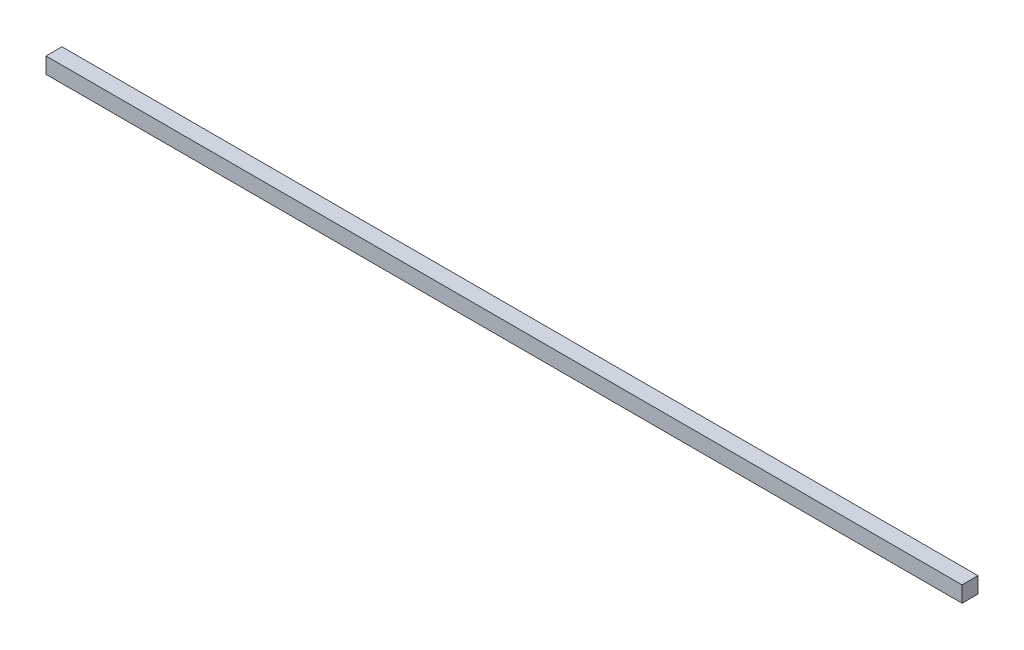
ISO-10303-21;
HEADER;
FILE_DESCRIPTION(('STEP AP214'),'2;1');
FILE_NAME('part.step','',(''),(''),'','','');
FILE_SCHEMA(('AUTOMOTIVE_DESIGN { 1 0 10303 214 1 1 1 1 }'));
ENDSEC;
DATA;
#1=APPLICATION_CONTEXT('core data for automotive mechanical design processes');
#2=APPLICATION_PROTOCOL_DEFINITION('international standard','automotive_design',2000,#1);
#3=PRODUCT_CONTEXT('',#1,'mechanical');
#4=PRODUCT('Part','Part','',(#3));
#5=PRODUCT_RELATED_PRODUCT_CATEGORY('part','',(#4));
#6=PRODUCT_DEFINITION_FORMATION('','',#4);
#7=PRODUCT_DEFINITION_CONTEXT('part definition',#1,'design');
#8=PRODUCT_DEFINITION('design','',#6,#7);
#9=PRODUCT_DEFINITION_SHAPE('','',#8);
#10=(LENGTH_UNIT() NAMED_UNIT(*) SI_UNIT(.MILLI.,.METRE.));
#11=(NAMED_UNIT(*) PLANE_ANGLE_UNIT() SI_UNIT($,.RADIAN.));
#12=(NAMED_UNIT(*) SI_UNIT($,.STERADIAN.) SOLID_ANGLE_UNIT());
#13=UNCERTAINTY_MEASURE_WITH_UNIT(LENGTH_MEASURE(1.E-05),#10,'distance_accuracy_value','');
#14=(GEOMETRIC_REPRESENTATION_CONTEXT(3) GLOBAL_UNCERTAINTY_ASSIGNED_CONTEXT((#13)) GLOBAL_UNIT_ASSIGNED_CONTEXT((#10,
#11,#12)) REPRESENTATION_CONTEXT('',''));
#15=CARTESIAN_POINT('',(0.,0.,0.));
#16=DIRECTION('',(0.,0.,1.));
#17=DIRECTION('',(1.,0.,0.));
#18=AXIS2_PLACEMENT_3D('',#15,#16,#17);
#19=CARTESIAN_POINT('',(1150.,0.,0.));
#20=DIRECTION('',(0.,0.,-1.));
#21=DIRECTION('',(-1.,0.,0.));
#22=AXIS2_PLACEMENT_3D('',#19,#20,#21);
#23=PLANE('',#22);
#24=DIRECTION('',(0.,-1.,0.));
#25=VECTOR('',#24,1.);
#26=CARTESIAN_POINT('',(0.,0.,0.));
#27=LINE('',#26,#25);
#28=CARTESIAN_POINT('',(0.,20.,0.));
#29=VERTEX_POINT('',#28);
#30=CARTESIAN_POINT('',(0.,0.,0.));
#31=VERTEX_POINT('',#30);
#32=EDGE_CURVE('E107',#29,#31,#27,.T.);
#33=ORIENTED_EDGE('',*,*,#32,.T.);
#34=DIRECTION('',(-1.,0.,0.));
#35=VECTOR('',#34,1.);
#36=CARTESIAN_POINT('',(1150.,0.,0.));
#37=LINE('',#36,#35);
#38=CARTESIAN_POINT('',(1150.,0.,0.));
#39=VERTEX_POINT('',#38);
#40=EDGE_CURVE('E11',#39,#31,#37,.T.);
#41=ORIENTED_EDGE('',*,*,#40,.F.);
#42=DIRECTION('',(0.,-1.,0.));
#43=VECTOR('',#42,1.);
#44=CARTESIAN_POINT('',(1150.,0.,0.));
#45=LINE('',#44,#43);
#46=CARTESIAN_POINT('',(1150.,20.,0.));
#47=VERTEX_POINT('',#46);
#48=EDGE_CURVE('E94',#47,#39,#45,.T.);
#49=ORIENTED_EDGE('',*,*,#48,.F.);
#50=DIRECTION('',(-1.,0.,0.));
#51=VECTOR('',#50,1.);
#52=CARTESIAN_POINT('',(1150.,20.,0.));
#53=LINE('',#52,#51);
#54=EDGE_CURVE('E103',#47,#29,#53,.T.);
#55=ORIENTED_EDGE('',*,*,#54,.T.);
#56=EDGE_LOOP('',(#33,#41,#49,#55));
#57=FACE_BOUND('',#56,.T.);
#58=ADVANCED_FACE('F38',(#57),#23,.F.);
#59=CARTESIAN_POINT('',(1150.,0.,0.));
#60=DIRECTION('',(0.,1.,0.));
#61=DIRECTION('',(0.,0.,1.));
#62=AXIS2_PLACEMENT_3D('',#59,#60,#61);
#63=PLANE('',#62);
#64=DIRECTION('',(0.,0.,-1.));
#65=VECTOR('',#64,1.);
#66=CARTESIAN_POINT('',(0.,0.,0.));
#67=LINE('',#66,#65);
#68=CARTESIAN_POINT('',(0.,0.,-20.));
#69=VERTEX_POINT('',#68);
#70=EDGE_CURVE('E98',#31,#69,#67,.T.);
#71=ORIENTED_EDGE('',*,*,#70,.T.);
#72=DIRECTION('',(-1.,0.,0.));
#73=VECTOR('',#72,1.);
#74=CARTESIAN_POINT('',(1150.,0.,-20.));
#75=LINE('',#74,#73);
#76=CARTESIAN_POINT('',(1150.,0.,-20.));
#77=VERTEX_POINT('',#76);
#78=EDGE_CURVE('E47',#77,#69,#75,.T.);
#79=ORIENTED_EDGE('',*,*,#78,.F.);
#80=DIRECTION('',(0.,0.,-1.));
#81=VECTOR('',#80,1.);
#82=CARTESIAN_POINT('',(1150.,0.,0.));
#83=LINE('',#82,#81);
#84=EDGE_CURVE('E89',#39,#77,#83,.T.);
#85=ORIENTED_EDGE('',*,*,#84,.F.);
#86=ORIENTED_EDGE('',*,*,#40,.T.);
#87=EDGE_LOOP('',(#71,#79,#85,#86));
#88=FACE_BOUND('',#87,.T.);
#89=ADVANCED_FACE('F97',(#88),#63,.F.);
#90=CARTESIAN_POINT('',(1150.,0.,-20.));
#91=DIRECTION('',(0.,0.,1.));
#92=DIRECTION('',(1.,0.,0.));
#93=AXIS2_PLACEMENT_3D('',#90,#91,#92);
#94=PLANE('',#93);
#95=DIRECTION('',(0.,1.,0.));
#96=VECTOR('',#95,1.);
#97=CARTESIAN_POINT('',(0.,0.,-20.));
#98=LINE('',#97,#96);
#99=CARTESIAN_POINT('',(0.,20.,-20.));
#100=VERTEX_POINT('',#99);
#101=EDGE_CURVE('E75',#69,#100,#98,.T.);
#102=ORIENTED_EDGE('',*,*,#101,.T.);
#103=DIRECTION('',(-1.,0.,0.));
#104=VECTOR('',#103,1.);
#105=CARTESIAN_POINT('',(1150.,20.,-20.));
#106=LINE('',#105,#104);
#107=CARTESIAN_POINT('',(1150.,20.,-20.));
#108=VERTEX_POINT('',#107);
#109=EDGE_CURVE('E100',#108,#100,#106,.T.);
#110=ORIENTED_EDGE('',*,*,#109,.F.);
#111=DIRECTION('',(0.,1.,0.));
#112=VECTOR('',#111,1.);
#113=CARTESIAN_POINT('',(1150.,0.,-20.));
#114=LINE('',#113,#112);
#115=EDGE_CURVE('E92',#77,#108,#114,.T.);
#116=ORIENTED_EDGE('',*,*,#115,.F.);
#117=ORIENTED_EDGE('',*,*,#78,.T.);
#118=EDGE_LOOP('',(#102,#110,#116,#117));
#119=FACE_BOUND('',#118,.T.);
#120=ADVANCED_FACE('F101',(#119),#94,.F.);
#121=CARTESIAN_POINT('',(1150.,20.,0.));
#122=DIRECTION('',(0.,-1.,0.));
#123=DIRECTION('',(0.,0.,-1.));
#124=AXIS2_PLACEMENT_3D('',#121,#122,#123);
#125=PLANE('',#124);
#126=DIRECTION('',(0.,0.,1.));
#127=VECTOR('',#126,1.);
#128=CARTESIAN_POINT('',(0.,20.,0.));
#129=LINE('',#128,#127);
#130=EDGE_CURVE('E82',#100,#29,#129,.T.);
#131=ORIENTED_EDGE('',*,*,#130,.T.);
#132=ORIENTED_EDGE('',*,*,#54,.F.);
#133=DIRECTION('',(0.,0.,1.));
#134=VECTOR('',#133,1.);
#135=CARTESIAN_POINT('',(1150.,20.,0.));
#136=LINE('',#135,#134);
#137=EDGE_CURVE('E55',#108,#47,#136,.T.);
#138=ORIENTED_EDGE('',*,*,#137,.F.);
#139=ORIENTED_EDGE('',*,*,#109,.T.);
#140=EDGE_LOOP('',(#131,#132,#138,#139));
#141=FACE_BOUND('',#140,.T.);
#142=ADVANCED_FACE('F120',(#141),#125,.F.);
#143=CARTESIAN_POINT('',(1150.,0.,0.));
#144=DIRECTION('',(-1.,0.,0.));
#145=DIRECTION('',(0.,0.,1.));
#146=AXIS2_PLACEMENT_3D('',#143,#144,#145);
#147=PLANE('',#146);
#148=ORIENTED_EDGE('',*,*,#48,.T.);
#149=ORIENTED_EDGE('',*,*,#84,.T.);
#150=ORIENTED_EDGE('',*,*,#115,.T.);
#151=ORIENTED_EDGE('',*,*,#137,.T.);
#152=EDGE_LOOP('',(#148,#149,#150,#151));
#153=FACE_BOUND('',#152,.T.);
#154=ADVANCED_FACE('F90',(#153),#147,.F.);
#155=CARTESIAN_POINT('',(0.,0.,0.));
#156=DIRECTION('',(-1.,0.,0.));
#157=DIRECTION('',(0.,0.,1.));
#158=AXIS2_PLACEMENT_3D('',#155,#156,#157);
#159=PLANE('',#158);
#160=ORIENTED_EDGE('',*,*,#32,.F.);
#161=ORIENTED_EDGE('',*,*,#130,.F.);
#162=ORIENTED_EDGE('',*,*,#101,.F.);
#163=ORIENTED_EDGE('',*,*,#70,.F.);
#164=EDGE_LOOP('',(#160,#161,#162,#163));
#165=FACE_BOUND('',#164,.T.);
#166=ADVANCED_FACE('F123',(#165),#159,.T.);
#167=CLOSED_SHELL('',(#58,#89,#120,#142,#154,#166));
#168=MANIFOLD_SOLID_BREP('B2',#167);
#169=ADVANCED_BREP_SHAPE_REPRESENTATION('',(#18,#168),#14);
#170=SHAPE_DEFINITION_REPRESENTATION(#9,#169);
ENDSEC;
END-ISO-10303-21;
